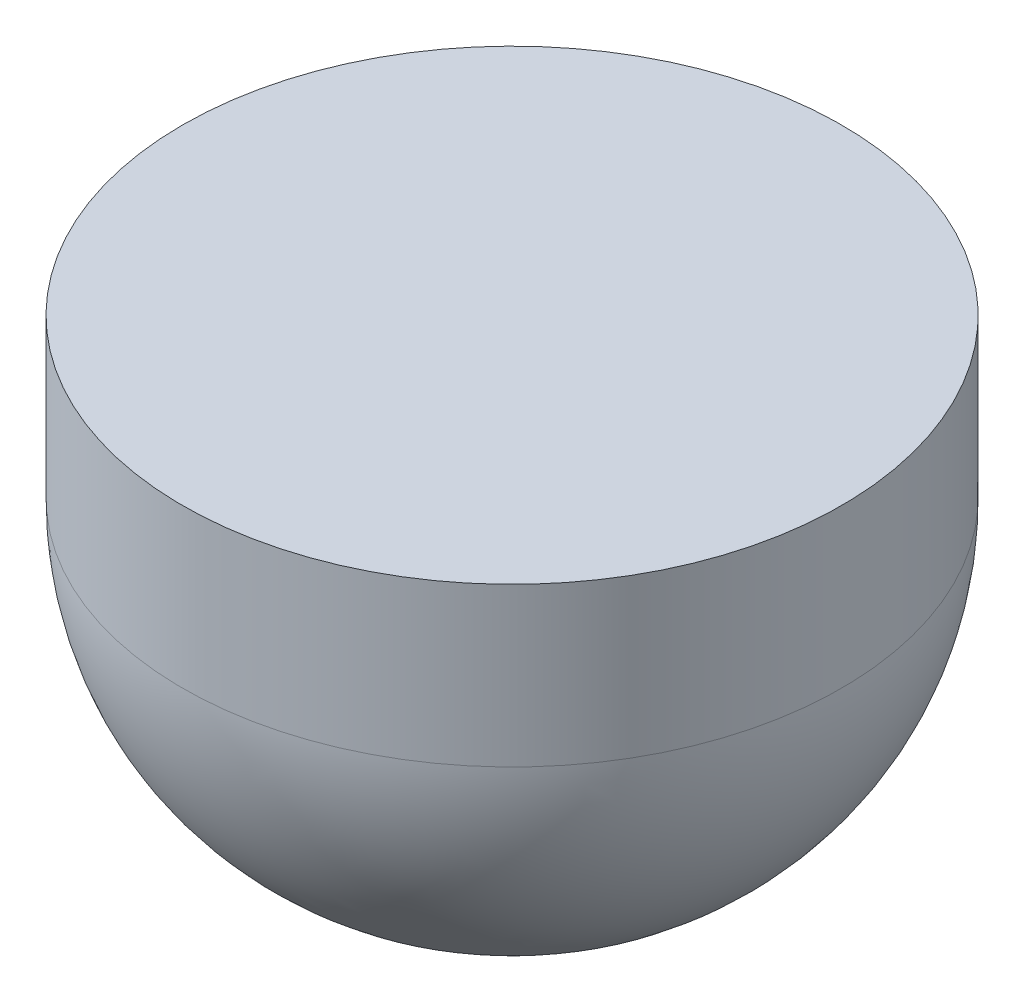
ISO-10303-21;
HEADER;
FILE_DESCRIPTION(('STEP AP214'),'2;1');
FILE_NAME('part.step','',(''),(''),'','','');
FILE_SCHEMA(('AUTOMOTIVE_DESIGN { 1 0 10303 214 1 1 1 1 }'));
ENDSEC;
DATA;
#1=APPLICATION_CONTEXT('core data for automotive mechanical design processes');
#2=APPLICATION_PROTOCOL_DEFINITION('international standard','automotive_design',2000,#1);
#3=PRODUCT_CONTEXT('',#1,'mechanical');
#4=PRODUCT('Part','Part','',(#3));
#5=PRODUCT_RELATED_PRODUCT_CATEGORY('part','',(#4));
#6=PRODUCT_DEFINITION_FORMATION('','',#4);
#7=PRODUCT_DEFINITION_CONTEXT('part definition',#1,'design');
#8=PRODUCT_DEFINITION('design','',#6,#7);
#9=PRODUCT_DEFINITION_SHAPE('','',#8);
#10=(LENGTH_UNIT() NAMED_UNIT(*) SI_UNIT(.MILLI.,.METRE.));
#11=(NAMED_UNIT(*) PLANE_ANGLE_UNIT() SI_UNIT($,.RADIAN.));
#12=(NAMED_UNIT(*) SI_UNIT($,.STERADIAN.) SOLID_ANGLE_UNIT());
#13=UNCERTAINTY_MEASURE_WITH_UNIT(LENGTH_MEASURE(1.E-05),#10,'distance_accuracy_value','');
#14=(GEOMETRIC_REPRESENTATION_CONTEXT(3) GLOBAL_UNCERTAINTY_ASSIGNED_CONTEXT((#13)) GLOBAL_UNIT_ASSIGNED_CONTEXT((#10,
#11,#12)) REPRESENTATION_CONTEXT('',''));
#15=CARTESIAN_POINT('',(0.,0.,0.));
#16=DIRECTION('',(0.,0.,1.));
#17=DIRECTION('',(1.,0.,0.));
#18=AXIS2_PLACEMENT_3D('',#15,#16,#17);
#19=CARTESIAN_POINT('',(0.,0.,0.));
#20=DIRECTION('',(0.,1.,0.));
#21=DIRECTION('',(-1.,0.,0.));
#22=AXIS2_PLACEMENT_3D('',#19,#20,#21);
#23=CYLINDRICAL_SURFACE('',#22,12.5);
#24=CARTESIAN_POINT('',(0.,-5.99999999999991,0.));
#25=DIRECTION('',(0.,1.,0.));
#26=DIRECTION('',(-1.,0.,0.));
#27=AXIS2_PLACEMENT_3D('',#24,#25,#26);
#28=CIRCLE('',#27,12.5);
#29=CARTESIAN_POINT('',(-12.5,-5.99999999999991,0.));
#30=VERTEX_POINT('',#29);
#31=EDGE_CURVE('E10',#30,#30,#28,.T.);
#32=ORIENTED_EDGE('',*,*,#31,.T.);
#33=EDGE_LOOP('',(#32));
#34=FACE_BOUND('',#33,.T.);
#35=CARTESIAN_POINT('',(0.,0.,0.));
#36=DIRECTION('',(0.,1.,0.));
#37=DIRECTION('',(-1.,0.,0.));
#38=AXIS2_PLACEMENT_3D('',#35,#36,#37);
#39=CIRCLE('',#38,12.5);
#40=CARTESIAN_POINT('',(-12.5,0.,0.));
#41=VERTEX_POINT('',#40);
#42=EDGE_CURVE('E43',#41,#41,#39,.T.);
#43=ORIENTED_EDGE('',*,*,#42,.F.);
#44=EDGE_LOOP('',(#43));
#45=FACE_BOUND('',#44,.T.);
#46=ADVANCED_FACE('F33',(#34,#45),#23,.T.);
#47=CARTESIAN_POINT('',(0.,-6.,0.));
#48=DIRECTION('',(0.,1.,0.));
#49=DIRECTION('',(-1.,0.,0.));
#50=AXIS2_PLACEMENT_3D('',#47,#48,#49);
#51=DEGENERATE_TOROIDAL_SURFACE('',#50,0.500000000000001,12.,.T.);
#52=CARTESIAN_POINT('',(0.,-18.,0.));
#53=DIRECTION('',(0.,1.,0.));
#54=DIRECTION('',(-1.,0.,0.));
#55=AXIS2_PLACEMENT_3D('',#52,#53,#54);
#56=CIRCLE('',#55,0.499999999999918);
#57=CARTESIAN_POINT('',(-0.499999999999915,-18.,0.));
#58=VERTEX_POINT('',#57);
#59=EDGE_CURVE('E39',#58,#58,#56,.T.);
#60=ORIENTED_EDGE('',*,*,#59,.T.);
#61=EDGE_LOOP('',(#60));
#62=FACE_BOUND('',#61,.T.);
#63=ORIENTED_EDGE('',*,*,#31,.F.);
#64=EDGE_LOOP('',(#63));
#65=FACE_BOUND('',#64,.T.);
#66=ADVANCED_FACE('F53',(#62,#65),#51,.T.);
#67=CARTESIAN_POINT('',(-0.499999999999915,-18.,0.));
#68=DIRECTION('',(0.,-1.,0.));
#69=DIRECTION('',(1.,0.,0.));
#70=AXIS2_PLACEMENT_3D('',#67,#68,#69);
#71=PLANE('',#70);
#72=ORIENTED_EDGE('',*,*,#59,.F.);
#73=EDGE_LOOP('',(#72));
#74=FACE_BOUND('',#73,.T.);
#75=ADVANCED_FACE('F57',(#74),#71,.T.);
#76=CARTESIAN_POINT('',(-12.5,0.,0.));
#77=DIRECTION('',(0.,1.,0.));
#78=DIRECTION('',(-1.,0.,0.));
#79=AXIS2_PLACEMENT_3D('',#76,#77,#78);
#80=PLANE('',#79);
#81=ORIENTED_EDGE('',*,*,#42,.T.);
#82=EDGE_LOOP('',(#81));
#83=FACE_BOUND('',#82,.T.);
#84=ADVANCED_FACE('F50',(#83),#80,.T.);
#85=CLOSED_SHELL('',(#46,#66,#75,#84));
#86=MANIFOLD_SOLID_BREP('B2',#85);
#87=ADVANCED_BREP_SHAPE_REPRESENTATION('',(#18,#86),#14);
#88=SHAPE_DEFINITION_REPRESENTATION(#9,#87);
ENDSEC;
END-ISO-10303-21;
